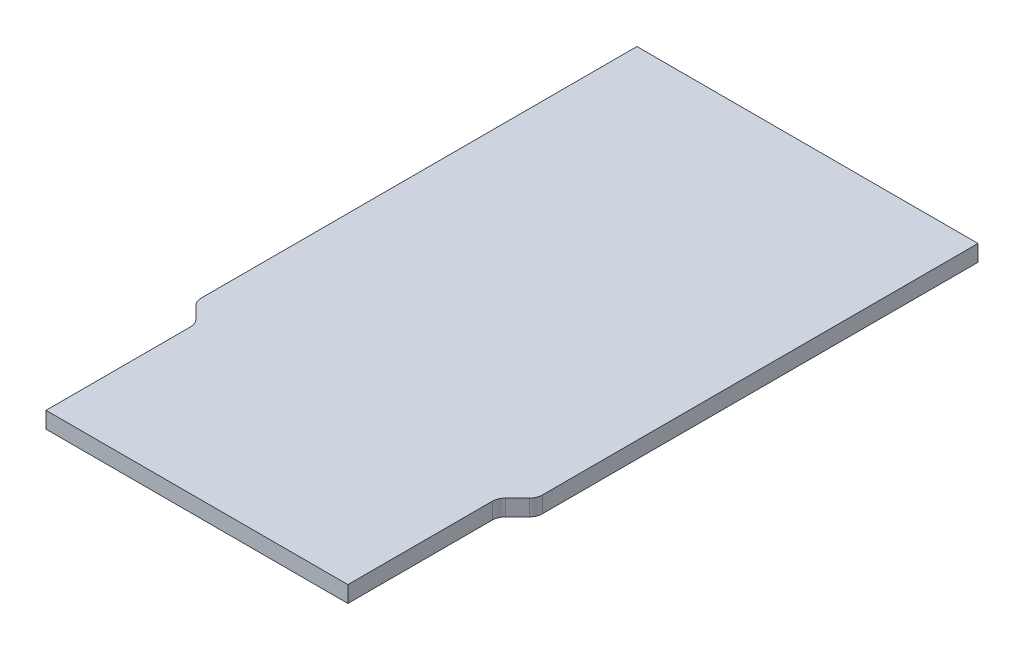
ISO-10303-21;
HEADER;
FILE_DESCRIPTION(('STEP AP214'),'2;1');
FILE_NAME('part.step','',(''),(''),'','','');
FILE_SCHEMA(('AUTOMOTIVE_DESIGN { 1 0 10303 214 1 1 1 1 }'));
ENDSEC;
DATA;
#1=APPLICATION_CONTEXT('core data for automotive mechanical design processes');
#2=APPLICATION_PROTOCOL_DEFINITION('international standard','automotive_design',2000,#1);
#3=PRODUCT_CONTEXT('',#1,'mechanical');
#4=PRODUCT('Part','Part','',(#3));
#5=PRODUCT_RELATED_PRODUCT_CATEGORY('part','',(#4));
#6=PRODUCT_DEFINITION_FORMATION('','',#4);
#7=PRODUCT_DEFINITION_CONTEXT('part definition',#1,'design');
#8=PRODUCT_DEFINITION('design','',#6,#7);
#9=PRODUCT_DEFINITION_SHAPE('','',#8);
#10=(LENGTH_UNIT() NAMED_UNIT(*) SI_UNIT(.MILLI.,.METRE.));
#11=(NAMED_UNIT(*) PLANE_ANGLE_UNIT() SI_UNIT($,.RADIAN.));
#12=(NAMED_UNIT(*) SI_UNIT($,.STERADIAN.) SOLID_ANGLE_UNIT());
#13=UNCERTAINTY_MEASURE_WITH_UNIT(LENGTH_MEASURE(1.E-05),#10,'distance_accuracy_value','');
#14=(GEOMETRIC_REPRESENTATION_CONTEXT(3) GLOBAL_UNCERTAINTY_ASSIGNED_CONTEXT((#13)) GLOBAL_UNIT_ASSIGNED_CONTEXT((#10,
#11,#12)) REPRESENTATION_CONTEXT('',''));
#15=CARTESIAN_POINT('',(0.,0.,0.));
#16=DIRECTION('',(0.,0.,1.));
#17=DIRECTION('',(1.,0.,0.));
#18=AXIS2_PLACEMENT_3D('',#15,#16,#17);
#19=CARTESIAN_POINT('',(-13.3427521616477,7.36119552615719,48.2385191324047));
#20=DIRECTION('',(0.,0.,1.));
#21=DIRECTION('',(1.,0.,0.));
#22=AXIS2_PLACEMENT_3D('',#19,#20,#21);
#23=PLANE('',#22);
#24=DIRECTION('',(1.,0.,0.));
#25=VECTOR('',#24,1.);
#26=CARTESIAN_POINT('',(-13.3427521616477,7.36119552615719,48.2385191324047));
#27=LINE('',#26,#25);
#28=CARTESIAN_POINT('',(-34.9427521616477,7.36119552615719,48.2385191324047));
#29=VERTEX_POINT('',#28);
#30=CARTESIAN_POINT('',(11.2572478383523,7.36119552615719,48.2385191324047));
#31=VERTEX_POINT('',#30);
#32=EDGE_CURVE('E213',#29,#31,#27,.T.);
#33=ORIENTED_EDGE('',*,*,#32,.T.);
#34=DIRECTION('',(0.,-1.,0.));
#35=VECTOR('',#34,1.);
#36=CARTESIAN_POINT('',(11.2572478383523,116.890247545588,48.2385191324047));
#37=LINE('',#36,#35);
#38=CARTESIAN_POINT('',(11.2572478383523,9.86119552615719,48.2385191324047));
#39=VERTEX_POINT('',#38);
#40=EDGE_CURVE('E169',#39,#31,#37,.T.);
#41=ORIENTED_EDGE('',*,*,#40,.F.);
#42=DIRECTION('',(1.,0.,0.));
#43=VECTOR('',#42,1.);
#44=CARTESIAN_POINT('',(-37.9427521616477,9.86119552615719,48.2385191324047));
#45=LINE('',#44,#43);
#46=CARTESIAN_POINT('',(-34.9427521616477,9.86119552615719,48.2385191324047));
#47=VERTEX_POINT('',#46);
#48=EDGE_CURVE('E56',#39,#47,#45,.F.);
#49=ORIENTED_EDGE('',*,*,#48,.T.);
#50=DIRECTION('',(0.,1.,0.));
#51=VECTOR('',#50,1.);
#52=CARTESIAN_POINT('',(-34.9427521616477,7.36119552615719,48.2385191324047));
#53=LINE('',#52,#51);
#54=EDGE_CURVE('E82',#29,#47,#53,.T.);
#55=ORIENTED_EDGE('',*,*,#54,.F.);
#56=EDGE_LOOP('',(#33,#41,#49,#55));
#57=FACE_BOUND('',#56,.T.);
#58=ADVANCED_FACE('F39',(#57),#23,.T.);
#59=CARTESIAN_POINT('',(-13.3427521616477,7.36119552615719,15.802027459301));
#60=DIRECTION('',(0.,1.,0.));
#61=DIRECTION('',(0.,0.,1.));
#62=AXIS2_PLACEMENT_3D('',#59,#60,#61);
#63=PLANE('',#62);
#64=DIRECTION('',(0.,0.,1.));
#65=VECTOR('',#64,1.);
#66=CARTESIAN_POINT('',(-37.9427521616477,7.36119552615719,15.802027459301));
#67=LINE('',#66,#65);
#68=CARTESIAN_POINT('',(-37.9427521616477,7.36119552615719,-45.197972540699));
#69=VERTEX_POINT('',#68);
#70=CARTESIAN_POINT('',(-37.9427521616477,7.36119552615719,21.473600334555));
#71=VERTEX_POINT('',#70);
#72=EDGE_CURVE('E199',#69,#71,#67,.T.);
#73=ORIENTED_EDGE('',*,*,#72,.F.);
#74=DIRECTION('',(-1.,0.,0.));
#75=VECTOR('',#74,1.);
#76=CARTESIAN_POINT('',(-13.3427521616477,7.36119552615719,-45.197972540699));
#77=LINE('',#76,#75);
#78=CARTESIAN_POINT('',(14.2572478383523,7.36119552615719,-45.197972540699));
#79=VERTEX_POINT('',#78);
#80=EDGE_CURVE('E147',#79,#69,#77,.T.);
#81=ORIENTED_EDGE('',*,*,#80,.F.);
#82=DIRECTION('',(0.,0.,1.));
#83=VECTOR('',#82,1.);
#84=CARTESIAN_POINT('',(14.2572478383523,7.36119552615719,-43.1979725406991));
#85=LINE('',#84,#83);
#86=CARTESIAN_POINT('',(14.2572478383523,7.36119552615719,21.473600334555));
#87=VERTEX_POINT('',#86);
#88=EDGE_CURVE('E163',#79,#87,#85,.T.);
#89=ORIENTED_EDGE('',*,*,#88,.T.);
#90=CARTESIAN_POINT('',(12.2572478383523,7.36119552615719,21.473600334555));
#91=DIRECTION('',(0.,-1.,0.));
#92=DIRECTION('',(1.,0.,0.));
#93=AXIS2_PLACEMENT_3D('',#90,#91,#92);
#94=CIRCLE('',#93,1.99999999999944);
#95=CARTESIAN_POINT('',(13.6714614007235,7.36119552615719,22.8878138969291));
#96=VERTEX_POINT('',#95);
#97=EDGE_CURVE('E176',#87,#96,#94,.T.);
#98=ORIENTED_EDGE('',*,*,#97,.T.);
#99=DIRECTION('',(-0.707106781185696,0.,0.707106781187399));
#100=VECTOR('',#99,1.);
#101=CARTESIAN_POINT('',(13.6714614007231,7.36119552615719,22.8878138969288));
#102=LINE('',#101,#100);
#103=CARTESIAN_POINT('',(11.8430342759823,7.36119552615719,24.716241021674));
#104=VERTEX_POINT('',#103);
#105=EDGE_CURVE('E179',#96,#104,#102,.T.);
#106=ORIENTED_EDGE('',*,*,#105,.T.);
#107=CARTESIAN_POINT('',(13.2572478383523,7.36119552615719,26.130454584051));
#108=DIRECTION('',(0.,-1.,0.));
#109=DIRECTION('',(1.,0.,0.));
#110=AXIS2_PLACEMENT_3D('',#107,#108,#109);
#111=CIRCLE('',#110,2.00000000000043);
#112=CARTESIAN_POINT('',(11.2572478383519,7.36119552615719,26.130454584051));
#113=VERTEX_POINT('',#112);
#114=EDGE_CURVE('E182',#113,#104,#111,.T.);
#115=ORIENTED_EDGE('',*,*,#114,.F.);
#116=DIRECTION('',(0.,0.,1.));
#117=VECTOR('',#116,1.);
#118=CARTESIAN_POINT('',(11.257247838352,7.36119552615719,26.130454584051));
#119=LINE('',#118,#117);
#120=EDGE_CURVE('E185',#113,#31,#119,.T.);
#121=ORIENTED_EDGE('',*,*,#120,.T.);
#122=ORIENTED_EDGE('',*,*,#32,.F.);
#123=DIRECTION('',(0.,0.,1.));
#124=VECTOR('',#123,1.);
#125=CARTESIAN_POINT('',(-34.9427521616473,7.36119552615719,15.8020274593007));
#126=LINE('',#125,#124);
#127=CARTESIAN_POINT('',(-34.9427521616474,7.36119552615719,26.130454584051));
#128=VERTEX_POINT('',#127);
#129=EDGE_CURVE('E211',#128,#29,#126,.T.);
#130=ORIENTED_EDGE('',*,*,#129,.F.);
#131=CARTESIAN_POINT('',(-36.9427521616477,7.36119552615719,26.130454584051));
#132=DIRECTION('',(0.,1.,0.));
#133=DIRECTION('',(0.,0.,1.));
#134=AXIS2_PLACEMENT_3D('',#131,#132,#133);
#135=CIRCLE('',#134,2.00000000000043);
#136=CARTESIAN_POINT('',(-35.5285385992777,7.36119552615719,24.716241021674));
#137=VERTEX_POINT('',#136);
#138=EDGE_CURVE('E208',#128,#137,#135,.T.);
#139=ORIENTED_EDGE('',*,*,#138,.T.);
#140=DIRECTION('',(0.707106781185696,0.,0.707106781187399));
#141=VECTOR('',#140,1.);
#142=CARTESIAN_POINT('',(-28.8927521616759,7.36119552615719,31.3520274592917));
#143=LINE('',#142,#141);
#144=CARTESIAN_POINT('',(-37.3569657240185,7.36119552615719,22.8878138969288));
#145=VERTEX_POINT('',#144);
#146=EDGE_CURVE('E205',#145,#137,#143,.T.);
#147=ORIENTED_EDGE('',*,*,#146,.F.);
#148=CARTESIAN_POINT('',(-35.9427521616477,7.36119552615719,21.473600334555));
#149=DIRECTION('',(0.,1.,0.));
#150=DIRECTION('',(0.,0.,1.));
#151=AXIS2_PLACEMENT_3D('',#148,#149,#150);
#152=CIRCLE('',#151,1.99999999999943);
#153=EDGE_CURVE('E202',#71,#145,#152,.T.);
#154=ORIENTED_EDGE('',*,*,#153,.F.);
#155=EDGE_LOOP('',(#73,#81,#89,#98,#106,#115,#121,#122,#130,#139,#147,#154));
#156=FACE_BOUND('',#155,.T.);
#157=ADVANCED_FACE('F234',(#156),#63,.F.);
#158=CARTESIAN_POINT('',(-34.9427521616477,43.7450790026372,47.185910935781));
#159=DIRECTION('',(1.,0.,0.));
#160=DIRECTION('',(0.,0.,-1.));
#161=AXIS2_PLACEMENT_3D('',#158,#159,#160);
#162=PLANE('',#161);
#163=ORIENTED_EDGE('',*,*,#54,.T.);
#164=DIRECTION('',(0.,0.,-1.));
#165=VECTOR('',#164,1.);
#166=CARTESIAN_POINT('',(-34.9427521616477,9.86119552615719,46.302027459301));
#167=LINE('',#166,#165);
#168=CARTESIAN_POINT('',(-34.9427521616477,9.86119552615719,26.130454584051));
#169=VERTEX_POINT('',#168);
#170=EDGE_CURVE('E78',#47,#169,#167,.T.);
#171=ORIENTED_EDGE('',*,*,#170,.T.);
#172=DIRECTION('',(0.,-1.,0.));
#173=VECTOR('',#172,1.);
#174=CARTESIAN_POINT('',(-34.9427521616477,9.86119552615719,26.130454584051));
#175=LINE('',#174,#173);
#176=EDGE_CURVE('E43',#169,#128,#175,.T.);
#177=ORIENTED_EDGE('',*,*,#176,.T.);
#178=ORIENTED_EDGE('',*,*,#129,.T.);
#179=EDGE_LOOP('',(#163,#171,#177,#178));
#180=FACE_BOUND('',#179,.T.);
#181=ADVANCED_FACE('F241',(#180),#162,.F.);
#182=CARTESIAN_POINT('',(-37.9427521616477,9.86119552615719,-45.197972540699));
#183=DIRECTION('',(0.,1.,0.));
#184=DIRECTION('',(0.,0.,-1.));
#185=AXIS2_PLACEMENT_3D('',#182,#183,#184);
#186=PLANE('',#185);
#187=DIRECTION('',(0.,0.,-1.));
#188=VECTOR('',#187,1.);
#189=CARTESIAN_POINT('',(14.2572478383523,9.86119552615719,-43.1979725406991));
#190=LINE('',#189,#188);
#191=CARTESIAN_POINT('',(14.2572478383523,9.86119552615719,21.473600334555));
#192=VERTEX_POINT('',#191);
#193=CARTESIAN_POINT('',(14.2572478383523,9.86119552615719,-45.197972540699));
#194=VERTEX_POINT('',#193);
#195=EDGE_CURVE('E137',#192,#194,#190,.T.);
#196=ORIENTED_EDGE('',*,*,#195,.T.);
#197=DIRECTION('',(1.,0.,0.));
#198=VECTOR('',#197,1.);
#199=CARTESIAN_POINT('',(-35.9427521616477,9.86119552615719,-45.197972540699));
#200=LINE('',#199,#198);
#201=CARTESIAN_POINT('',(-37.9427521616477,9.86119552615719,-45.197972540699));
#202=VERTEX_POINT('',#201);
#203=EDGE_CURVE('E140',#202,#194,#200,.T.);
#204=ORIENTED_EDGE('',*,*,#203,.F.);
#205=DIRECTION('',(0.,0.,1.));
#206=VECTOR('',#205,1.);
#207=CARTESIAN_POINT('',(-37.9427521616477,9.86119552615719,-43.197972540699));
#208=LINE('',#207,#206);
#209=CARTESIAN_POINT('',(-37.9427521616477,9.86119552615719,21.473600334555));
#210=VERTEX_POINT('',#209);
#211=EDGE_CURVE('E11',#202,#210,#208,.T.);
#212=ORIENTED_EDGE('',*,*,#211,.T.);
#213=CARTESIAN_POINT('',(-35.9427521616477,9.86119552615719,21.473600334555));
#214=DIRECTION('',(0.,1.,0.));
#215=DIRECTION('',(-1.,0.,0.));
#216=AXIS2_PLACEMENT_3D('',#213,#214,#215);
#217=CIRCLE('',#216,2.);
#218=CARTESIAN_POINT('',(-37.3569657240177,9.86119552615719,22.887813896928));
#219=VERTEX_POINT('',#218);
#220=EDGE_CURVE('E48',#210,#219,#217,.T.);
#221=ORIENTED_EDGE('',*,*,#220,.T.);
#222=DIRECTION('',(-0.707106781186548,0.,-0.707106781186548));
#223=VECTOR('',#222,1.);
#224=CARTESIAN_POINT('',(-35.5285385992777,9.86119552615719,24.716241021674));
#225=LINE('',#224,#223);
#226=CARTESIAN_POINT('',(-35.5285385992777,9.86119552615719,24.716241021674));
#227=VERTEX_POINT('',#226);
#228=EDGE_CURVE('E218',#227,#219,#225,.T.);
#229=ORIENTED_EDGE('',*,*,#228,.F.);
#230=CARTESIAN_POINT('',(-36.9427521616477,9.86119552615719,26.130454584051));
#231=DIRECTION('',(0.,-1.,0.));
#232=DIRECTION('',(0.707106781186548,0.,-0.707106781186548));
#233=AXIS2_PLACEMENT_3D('',#230,#231,#232);
#234=CIRCLE('',#233,2.);
#235=EDGE_CURVE('E157',#227,#169,#234,.T.);
#236=ORIENTED_EDGE('',*,*,#235,.T.);
#237=ORIENTED_EDGE('',*,*,#170,.F.);
#238=ORIENTED_EDGE('',*,*,#48,.F.);
#239=DIRECTION('',(0.,0.,-1.));
#240=VECTOR('',#239,1.);
#241=CARTESIAN_POINT('',(11.257247838352,9.86119552615719,26.130454584051));
#242=LINE('',#241,#240);
#243=CARTESIAN_POINT('',(11.2572478383519,9.86119552615719,26.130454584051));
#244=VERTEX_POINT('',#243);
#245=EDGE_CURVE('E148',#39,#244,#242,.T.);
#246=ORIENTED_EDGE('',*,*,#245,.T.);
#247=CARTESIAN_POINT('',(13.2572478383523,9.86119552615719,26.130454584051));
#248=DIRECTION('',(0.,-1.,0.));
#249=DIRECTION('',(1.,0.,0.));
#250=AXIS2_PLACEMENT_3D('',#247,#248,#249);
#251=CIRCLE('',#250,2.00000000000043);
#252=CARTESIAN_POINT('',(11.8430342759823,9.86119552615719,24.716241021674));
#253=VERTEX_POINT('',#252);
#254=EDGE_CURVE('E171',#253,#244,#251,.F.);
#255=ORIENTED_EDGE('',*,*,#254,.F.);
#256=DIRECTION('',(0.707106781185696,0.,-0.707106781187399));
#257=VECTOR('',#256,1.);
#258=CARTESIAN_POINT('',(13.6714614007231,9.86119552615719,22.8878138969288));
#259=LINE('',#258,#257);
#260=CARTESIAN_POINT('',(13.6714614007235,9.86119552615719,22.8878138969291));
#261=VERTEX_POINT('',#260);
#262=EDGE_CURVE('E168',#253,#261,#259,.T.);
#263=ORIENTED_EDGE('',*,*,#262,.T.);
#264=CARTESIAN_POINT('',(12.2572478383523,9.86119552615719,21.473600334555));
#265=DIRECTION('',(0.,-1.,0.));
#266=DIRECTION('',(1.,0.,0.));
#267=AXIS2_PLACEMENT_3D('',#264,#265,#266);
#268=CIRCLE('',#267,1.99999999999944);
#269=EDGE_CURVE('E143',#261,#192,#268,.F.);
#270=ORIENTED_EDGE('',*,*,#269,.T.);
#271=EDGE_LOOP('',(#196,#204,#212,#221,#229,#236,#237,#238,#246,#255,#263,#270));
#272=FACE_BOUND('',#271,.T.);
#273=ADVANCED_FACE('F139',(#272),#186,.T.);
#274=CARTESIAN_POINT('',(-13.3427521616477,9.11119552615719,-45.197972540699));
#275=DIRECTION('',(0.,0.,1.));
#276=DIRECTION('',(-1.,0.,0.));
#277=AXIS2_PLACEMENT_3D('',#274,#275,#276);
#278=PLANE('',#277);
#279=ORIENTED_EDGE('',*,*,#203,.T.);
#280=DIRECTION('',(0.,1.,0.));
#281=VECTOR('',#280,1.);
#282=CARTESIAN_POINT('',(14.2572478383523,-44.8771045993254,-45.197972540699));
#283=LINE('',#282,#281);
#284=EDGE_CURVE('E154',#79,#194,#283,.T.);
#285=ORIENTED_EDGE('',*,*,#284,.F.);
#286=ORIENTED_EDGE('',*,*,#80,.T.);
#287=DIRECTION('',(0.,1.,0.));
#288=VECTOR('',#287,1.);
#289=CARTESIAN_POINT('',(-37.9427521616477,-44.8771045993254,-45.197972540699));
#290=LINE('',#289,#288);
#291=EDGE_CURVE('E156',#69,#202,#290,.T.);
#292=ORIENTED_EDGE('',*,*,#291,.T.);
#293=EDGE_LOOP('',(#279,#285,#286,#292));
#294=FACE_BOUND('',#293,.T.);
#295=ADVANCED_FACE('F153',(#294),#278,.F.);
#296=CARTESIAN_POINT('',(-37.9427521616477,9.11119552615719,0.552027459300955));
#297=DIRECTION('',(-1.,0.,0.));
#298=DIRECTION('',(0.,0.,-1.));
#299=AXIS2_PLACEMENT_3D('',#296,#297,#298);
#300=PLANE('',#299);
#301=ORIENTED_EDGE('',*,*,#211,.F.);
#302=ORIENTED_EDGE('',*,*,#291,.F.);
#303=ORIENTED_EDGE('',*,*,#72,.T.);
#304=DIRECTION('',(0.,1.,0.));
#305=VECTOR('',#304,1.);
#306=CARTESIAN_POINT('',(-37.9427521616477,8.36119552615719,21.473600334555));
#307=LINE('',#306,#305);
#308=EDGE_CURVE('E158',#71,#210,#307,.T.);
#309=ORIENTED_EDGE('',*,*,#308,.T.);
#310=EDGE_LOOP('',(#301,#302,#303,#309));
#311=FACE_BOUND('',#310,.T.);
#312=ADVANCED_FACE('F239',(#311),#300,.T.);
#313=CARTESIAN_POINT('',(-35.9427521616477,-39.2202044738428,21.473600334555));
#314=DIRECTION('',(0.,1.,0.));
#315=DIRECTION('',(1.,0.,0.));
#316=AXIS2_PLACEMENT_3D('',#313,#314,#315);
#317=CYLINDRICAL_SURFACE('',#316,2.);
#318=ORIENTED_EDGE('',*,*,#308,.F.);
#319=ORIENTED_EDGE('',*,*,#153,.T.);
#320=DIRECTION('',(0.,1.,0.));
#321=VECTOR('',#320,1.);
#322=CARTESIAN_POINT('',(-37.3569657240177,8.36119552615719,22.887813896928));
#323=LINE('',#322,#321);
#324=EDGE_CURVE('E220',#145,#219,#323,.T.);
#325=ORIENTED_EDGE('',*,*,#324,.T.);
#326=ORIENTED_EDGE('',*,*,#220,.F.);
#327=EDGE_LOOP('',(#318,#319,#325,#326));
#328=FACE_BOUND('',#327,.T.);
#329=ADVANCED_FACE('F237',(#328),#317,.T.);
#330=CARTESIAN_POINT('',(-36.4427521616477,9.11119552615719,23.802027459301));
#331=DIRECTION('',(0.707106781186548,0.,-0.707106781186548));
#332=DIRECTION('',(0.707106781186548,0.,0.707106781186548));
#333=AXIS2_PLACEMENT_3D('',#330,#331,#332);
#334=PLANE('',#333);
#335=ORIENTED_EDGE('',*,*,#324,.F.);
#336=ORIENTED_EDGE('',*,*,#146,.T.);
#337=DIRECTION('',(0.,-1.,0.));
#338=VECTOR('',#337,1.);
#339=CARTESIAN_POINT('',(-35.5285385992777,9.86119552615719,24.716241021674));
#340=LINE('',#339,#338);
#341=EDGE_CURVE('E221',#227,#137,#340,.T.);
#342=ORIENTED_EDGE('',*,*,#341,.F.);
#343=ORIENTED_EDGE('',*,*,#228,.T.);
#344=EDGE_LOOP('',(#335,#336,#342,#343));
#345=FACE_BOUND('',#344,.T.);
#346=ADVANCED_FACE('F236',(#345),#334,.F.);
#347=CARTESIAN_POINT('',(-36.9427521616477,92.4425955261572,26.130454584051));
#348=DIRECTION('',(0.,-1.,0.));
#349=DIRECTION('',(-0.707106781186547,0.,0.707106781186548));
#350=AXIS2_PLACEMENT_3D('',#347,#348,#349);
#351=CYLINDRICAL_SURFACE('',#350,2.);
#352=ORIENTED_EDGE('',*,*,#341,.T.);
#353=ORIENTED_EDGE('',*,*,#138,.F.);
#354=ORIENTED_EDGE('',*,*,#176,.F.);
#355=ORIENTED_EDGE('',*,*,#235,.F.);
#356=EDGE_LOOP('',(#352,#353,#354,#355));
#357=FACE_BOUND('',#356,.T.);
#358=ADVANCED_FACE('F41',(#357),#351,.F.);
#359=CARTESIAN_POINT('',(14.2572478383523,116.890247545588,-43.197972540699));
#360=DIRECTION('',(1.,0.,0.));
#361=DIRECTION('',(0.,1.,0.));
#362=AXIS2_PLACEMENT_3D('',#359,#360,#361);
#363=PLANE('',#362);
#364=ORIENTED_EDGE('',*,*,#195,.F.);
#365=DIRECTION('',(0.,-1.,0.));
#366=VECTOR('',#365,1.);
#367=CARTESIAN_POINT('',(14.2572478383523,116.890247545588,21.473600334555));
#368=LINE('',#367,#366);
#369=EDGE_CURVE('E188',#192,#87,#368,.T.);
#370=ORIENTED_EDGE('',*,*,#369,.T.);
#371=ORIENTED_EDGE('',*,*,#88,.F.);
#372=ORIENTED_EDGE('',*,*,#284,.T.);
#373=EDGE_LOOP('',(#364,#370,#371,#372));
#374=FACE_BOUND('',#373,.T.);
#375=ADVANCED_FACE('F161',(#374),#363,.T.);
#376=CARTESIAN_POINT('',(12.2572478383523,116.890247545588,21.473600334555));
#377=DIRECTION('',(0.,-1.,0.));
#378=DIRECTION('',(1.,0.,0.));
#379=AXIS2_PLACEMENT_3D('',#376,#377,#378);
#380=CYLINDRICAL_SURFACE('',#379,1.99999999999944);
#381=ORIENTED_EDGE('',*,*,#269,.F.);
#382=DIRECTION('',(0.,-1.,0.));
#383=VECTOR('',#382,1.);
#384=CARTESIAN_POINT('',(13.6714614007235,116.890247545588,22.8878138969292));
#385=LINE('',#384,#383);
#386=EDGE_CURVE('E195',#261,#96,#385,.T.);
#387=ORIENTED_EDGE('',*,*,#386,.T.);
#388=ORIENTED_EDGE('',*,*,#97,.F.);
#389=ORIENTED_EDGE('',*,*,#369,.F.);
#390=EDGE_LOOP('',(#381,#387,#388,#389));
#391=FACE_BOUND('',#390,.T.);
#392=ADVANCED_FACE('F260',(#391),#380,.T.);
#393=CARTESIAN_POINT('',(13.6714614007231,116.890247545588,22.8878138969288));
#394=DIRECTION('',(0.707106781187399,0.,0.707106781185696));
#395=DIRECTION('',(0.707106781185696,0.,-0.707106781187399));
#396=AXIS2_PLACEMENT_3D('',#393,#394,#395);
#397=PLANE('',#396);
#398=ORIENTED_EDGE('',*,*,#262,.F.);
#399=DIRECTION('',(0.,-1.,0.));
#400=VECTOR('',#399,1.);
#401=CARTESIAN_POINT('',(11.8430342759823,116.890247545588,24.716241021674));
#402=LINE('',#401,#400);
#403=EDGE_CURVE('E193',#253,#104,#402,.T.);
#404=ORIENTED_EDGE('',*,*,#403,.T.);
#405=ORIENTED_EDGE('',*,*,#105,.F.);
#406=ORIENTED_EDGE('',*,*,#386,.F.);
#407=EDGE_LOOP('',(#398,#404,#405,#406));
#408=FACE_BOUND('',#407,.T.);
#409=ADVANCED_FACE('F262',(#408),#397,.T.);
#410=CARTESIAN_POINT('',(13.2572478383523,116.890247545588,26.130454584051));
#411=DIRECTION('',(0.,-1.,0.));
#412=DIRECTION('',(1.,0.,0.));
#413=AXIS2_PLACEMENT_3D('',#410,#411,#412);
#414=CYLINDRICAL_SURFACE('',#413,2.00000000000043);
#415=ORIENTED_EDGE('',*,*,#403,.F.);
#416=ORIENTED_EDGE('',*,*,#254,.T.);
#417=DIRECTION('',(0.,-1.,0.));
#418=VECTOR('',#417,1.);
#419=CARTESIAN_POINT('',(11.2572478383519,116.890247545588,26.130454584051));
#420=LINE('',#419,#418);
#421=EDGE_CURVE('E191',#244,#113,#420,.T.);
#422=ORIENTED_EDGE('',*,*,#421,.T.);
#423=ORIENTED_EDGE('',*,*,#114,.T.);
#424=EDGE_LOOP('',(#415,#416,#422,#423));
#425=FACE_BOUND('',#424,.T.);
#426=ADVANCED_FACE('F266',(#425),#414,.F.);
#427=CARTESIAN_POINT('',(11.257247838352,116.890247545588,26.130454584051));
#428=DIRECTION('',(1.,0.,0.));
#429=DIRECTION('',(0.,0.,-1.));
#430=AXIS2_PLACEMENT_3D('',#427,#428,#429);
#431=PLANE('',#430);
#432=ORIENTED_EDGE('',*,*,#245,.F.);
#433=ORIENTED_EDGE('',*,*,#40,.T.);
#434=ORIENTED_EDGE('',*,*,#120,.F.);
#435=ORIENTED_EDGE('',*,*,#421,.F.);
#436=EDGE_LOOP('',(#432,#433,#434,#435));
#437=FACE_BOUND('',#436,.T.);
#438=ADVANCED_FACE('F270',(#437),#431,.T.);
#439=CLOSED_SHELL('',(#58,#157,#181,#273,#295,#312,#329,#346,#358,#375,#392,#409,#426,#438));
#440=MANIFOLD_SOLID_BREP('B2',#439);
#441=ADVANCED_BREP_SHAPE_REPRESENTATION('',(#18,#440),#14);
#442=SHAPE_DEFINITION_REPRESENTATION(#9,#441);
ENDSEC;
END-ISO-10303-21;
